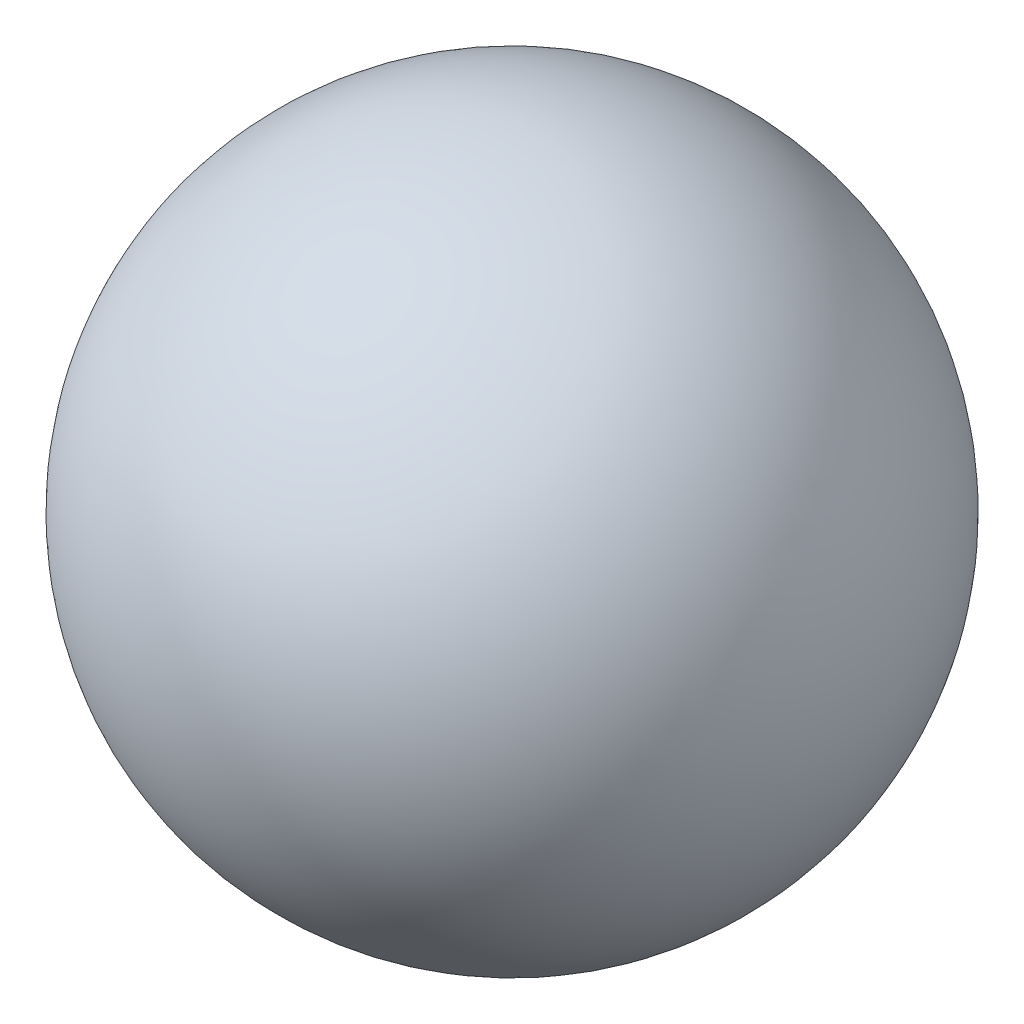
ISO-10303-21;
HEADER;
FILE_DESCRIPTION(('STEP AP214'),'2;1');
FILE_NAME('part.step','',(''),(''),'','','');
FILE_SCHEMA(('AUTOMOTIVE_DESIGN { 1 0 10303 214 1 1 1 1 }'));
ENDSEC;
DATA;
#1=APPLICATION_CONTEXT('core data for automotive mechanical design processes');
#2=APPLICATION_PROTOCOL_DEFINITION('international standard','automotive_design',2000,#1);
#3=PRODUCT_CONTEXT('',#1,'mechanical');
#4=PRODUCT('Part','Part','',(#3));
#5=PRODUCT_RELATED_PRODUCT_CATEGORY('part','',(#4));
#6=PRODUCT_DEFINITION_FORMATION('','',#4);
#7=PRODUCT_DEFINITION_CONTEXT('part definition',#1,'design');
#8=PRODUCT_DEFINITION('design','',#6,#7);
#9=PRODUCT_DEFINITION_SHAPE('','',#8);
#10=(LENGTH_UNIT() NAMED_UNIT(*) SI_UNIT(.MILLI.,.METRE.));
#11=(NAMED_UNIT(*) PLANE_ANGLE_UNIT() SI_UNIT($,.RADIAN.));
#12=(NAMED_UNIT(*) SI_UNIT($,.STERADIAN.) SOLID_ANGLE_UNIT());
#13=UNCERTAINTY_MEASURE_WITH_UNIT(LENGTH_MEASURE(1.E-05),#10,'distance_accuracy_value','');
#14=(GEOMETRIC_REPRESENTATION_CONTEXT(3) GLOBAL_UNCERTAINTY_ASSIGNED_CONTEXT((#13)) GLOBAL_UNIT_ASSIGNED_CONTEXT((#10,
#11,#12)) REPRESENTATION_CONTEXT('',''));
#15=CARTESIAN_POINT('',(0.,0.,0.));
#16=DIRECTION('',(0.,0.,1.));
#17=DIRECTION('',(1.,0.,0.));
#18=AXIS2_PLACEMENT_3D('',#15,#16,#17);
#19=CARTESIAN_POINT('',(5.,13.,0.));
#20=DIRECTION('',(1.,0.,0.));
#21=DIRECTION('',(0.,-1.,0.));
#22=AXIS2_PLACEMENT_3D('',#19,#20,#21);
#23=SPHERICAL_SURFACE('',#22,2.381);
#24=CARTESIAN_POINT('',(2.619,13.,0.));
#25=VERTEX_POINT('',#24);
#26=VERTEX_LOOP('',#25);
#27=FACE_BOUND('',#26,.T.);
#28=ADVANCED_FACE('F14',(#27),#23,.T.);
#29=CLOSED_SHELL('',(#28));
#30=MANIFOLD_SOLID_BREP('B1',#29);
#31=ADVANCED_BREP_SHAPE_REPRESENTATION('',(#18,#30),#14);
#32=SHAPE_DEFINITION_REPRESENTATION(#9,#31);
ENDSEC;
END-ISO-10303-21;
